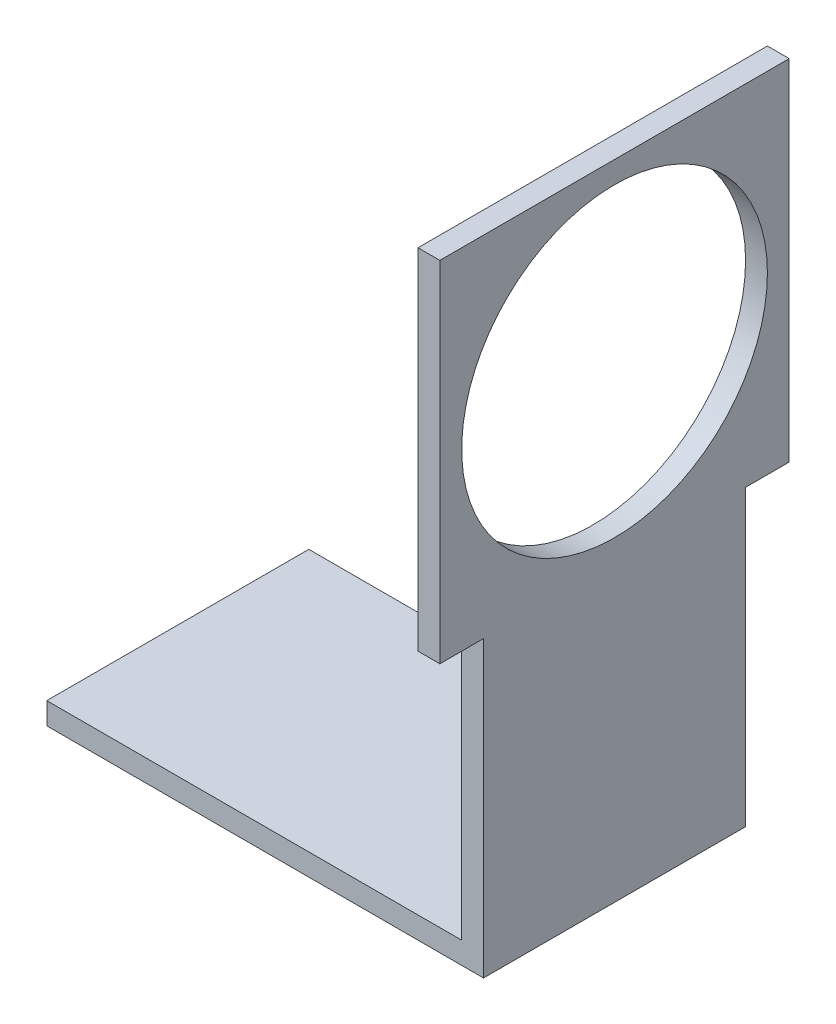
ISO-10303-21;
HEADER;
FILE_DESCRIPTION(('STEP AP214'),'2;1');
FILE_NAME('part.step','',(''),(''),'','','');
FILE_SCHEMA(('AUTOMOTIVE_DESIGN { 1 0 10303 214 1 1 1 1 }'));
ENDSEC;
DATA;
#1=APPLICATION_CONTEXT('core data for automotive mechanical design processes');
#2=APPLICATION_PROTOCOL_DEFINITION('international standard','automotive_design',2000,#1);
#3=PRODUCT_CONTEXT('',#1,'mechanical');
#4=PRODUCT('Part','Part','',(#3));
#5=PRODUCT_RELATED_PRODUCT_CATEGORY('part','',(#4));
#6=PRODUCT_DEFINITION_FORMATION('','',#4);
#7=PRODUCT_DEFINITION_CONTEXT('part definition',#1,'design');
#8=PRODUCT_DEFINITION('design','',#6,#7);
#9=PRODUCT_DEFINITION_SHAPE('','',#8);
#10=(LENGTH_UNIT() NAMED_UNIT(*) SI_UNIT(.MILLI.,.METRE.));
#11=(NAMED_UNIT(*) PLANE_ANGLE_UNIT() SI_UNIT($,.RADIAN.));
#12=(NAMED_UNIT(*) SI_UNIT($,.STERADIAN.) SOLID_ANGLE_UNIT());
#13=UNCERTAINTY_MEASURE_WITH_UNIT(LENGTH_MEASURE(1.E-05),#10,'distance_accuracy_value','');
#14=(GEOMETRIC_REPRESENTATION_CONTEXT(3) GLOBAL_UNCERTAINTY_ASSIGNED_CONTEXT((#13)) GLOBAL_UNIT_ASSIGNED_CONTEXT((#10,
#11,#12)) REPRESENTATION_CONTEXT('',''));
#15=CARTESIAN_POINT('',(0.,0.,0.));
#16=DIRECTION('',(0.,0.,1.));
#17=DIRECTION('',(1.,0.,0.));
#18=AXIS2_PLACEMENT_3D('',#15,#16,#17);
#19=CARTESIAN_POINT('',(-93.0573248407643,5.,-30.7643312101911));
#20=DIRECTION('',(1.,0.,0.));
#21=DIRECTION('',(0.,0.,-1.));
#22=AXIS2_PLACEMENT_3D('',#19,#20,#21);
#23=PLANE('',#22);
#24=DIRECTION('',(0.,0.,1.));
#25=VECTOR('',#24,1.);
#26=CARTESIAN_POINT('',(-93.0573248407643,0.,-30.7643312101911));
#27=LINE('',#26,#25);
#28=CARTESIAN_POINT('',(-93.0573248407643,0.,-30.7643312101911));
#29=VERTEX_POINT('',#28);
#30=CARTESIAN_POINT('',(-93.0573248407643,0.,29.2356687898089));
#31=VERTEX_POINT('',#30);
#32=EDGE_CURVE('E97',#29,#31,#27,.T.);
#33=ORIENTED_EDGE('',*,*,#32,.T.);
#34=DIRECTION('',(0.,-1.,0.));
#35=VECTOR('',#34,1.);
#36=CARTESIAN_POINT('',(-93.0573248407643,5.,29.2356687898089));
#37=LINE('',#36,#35);
#38=CARTESIAN_POINT('',(-93.0573248407643,5.,29.2356687898089));
#39=VERTEX_POINT('',#38);
#40=EDGE_CURVE('E11',#39,#31,#37,.T.);
#41=ORIENTED_EDGE('',*,*,#40,.F.);
#42=DIRECTION('',(0.,0.,1.));
#43=VECTOR('',#42,1.);
#44=CARTESIAN_POINT('',(-93.0573248407643,5.,-30.7643312101911));
#45=LINE('',#44,#43);
#46=CARTESIAN_POINT('',(-93.0573248407643,5.,-30.7643312101911));
#47=VERTEX_POINT('',#46);
#48=EDGE_CURVE('E91',#47,#39,#45,.T.);
#49=ORIENTED_EDGE('',*,*,#48,.F.);
#50=DIRECTION('',(0.,-1.,0.));
#51=VECTOR('',#50,1.);
#52=CARTESIAN_POINT('',(-93.0573248407643,5.,-30.7643312101911));
#53=LINE('',#52,#51);
#54=EDGE_CURVE('E82',#47,#29,#53,.T.);
#55=ORIENTED_EDGE('',*,*,#54,.T.);
#56=EDGE_LOOP('',(#33,#41,#49,#55));
#57=FACE_BOUND('',#56,.T.);
#58=ADVANCED_FACE('F39',(#57),#23,.F.);
#59=CARTESIAN_POINT('',(-93.0573248407643,5.,29.2356687898089));
#60=DIRECTION('',(0.,0.,-1.));
#61=DIRECTION('',(-1.,0.,0.));
#62=AXIS2_PLACEMENT_3D('',#59,#60,#61);
#63=PLANE('',#62);
#64=DIRECTION('',(1.,0.,0.));
#65=VECTOR('',#64,1.);
#66=CARTESIAN_POINT('',(-93.0573248407643,0.,29.2356687898089));
#67=LINE('',#66,#65);
#68=CARTESIAN_POINT('',(6.94267515923568,0.,29.2356687898089));
#69=VERTEX_POINT('',#68);
#70=EDGE_CURVE('E101',#31,#69,#67,.T.);
#71=ORIENTED_EDGE('',*,*,#70,.T.);
#72=DIRECTION('',(0.,-1.,0.));
#73=VECTOR('',#72,1.);
#74=CARTESIAN_POINT('',(6.94267515923568,5.,29.2356687898089));
#75=LINE('',#74,#73);
#76=CARTESIAN_POINT('',(6.94267515923568,67.3,29.2356687898089));
#77=VERTEX_POINT('',#76);
#78=EDGE_CURVE('E47',#77,#69,#75,.T.);
#79=ORIENTED_EDGE('',*,*,#78,.F.);
#80=DIRECTION('',(1.,0.,0.));
#81=VECTOR('',#80,1.);
#82=CARTESIAN_POINT('',(6.94267515923566,67.3,29.2356687898089));
#83=LINE('',#82,#81);
#84=CARTESIAN_POINT('',(1.94267515923567,67.3,29.2356687898089));
#85=VERTEX_POINT('',#84);
#86=EDGE_CURVE('E132',#85,#77,#83,.T.);
#87=ORIENTED_EDGE('',*,*,#86,.F.);
#88=DIRECTION('',(0.,-1.,0.));
#89=VECTOR('',#88,1.);
#90=CARTESIAN_POINT('',(1.94267515923567,67.3,29.2356687898089));
#91=LINE('',#90,#89);
#92=CARTESIAN_POINT('',(1.94267515923567,5.,29.2356687898089));
#93=VERTEX_POINT('',#92);
#94=EDGE_CURVE('E109',#85,#93,#91,.T.);
#95=ORIENTED_EDGE('',*,*,#94,.T.);
#96=DIRECTION('',(1.,0.,0.));
#97=VECTOR('',#96,1.);
#98=CARTESIAN_POINT('',(-93.0573248407643,5.,29.2356687898089));
#99=LINE('',#98,#97);
#100=EDGE_CURVE('E158',#39,#93,#99,.T.);
#101=ORIENTED_EDGE('',*,*,#100,.F.);
#102=ORIENTED_EDGE('',*,*,#40,.T.);
#103=EDGE_LOOP('',(#71,#79,#87,#95,#101,#102));
#104=FACE_BOUND('',#103,.T.);
#105=ADVANCED_FACE('F130',(#104),#63,.F.);
#106=CARTESIAN_POINT('',(6.94267515923566,5.,-30.7643312101911));
#107=DIRECTION('',(-1.,0.,0.));
#108=DIRECTION('',(0.,0.,1.));
#109=AXIS2_PLACEMENT_3D('',#106,#107,#108);
#110=PLANE('',#109);
#111=CARTESIAN_POINT('',(6.94267515923567,107.3,-0.764331210191082));
#112=DIRECTION('',(1.,0.,0.));
#113=DIRECTION('',(0.,0.,-1.));
#114=AXIS2_PLACEMENT_3D('',#111,#112,#113);
#115=CIRCLE('',#114,35.);
#116=CARTESIAN_POINT('',(6.94267515923566,107.3,-35.7643312101911));
#117=VERTEX_POINT('',#116);
#118=EDGE_CURVE('E193',#117,#117,#115,.T.);
#119=ORIENTED_EDGE('',*,*,#118,.F.);
#120=EDGE_LOOP('',(#119));
#121=FACE_BOUND('',#120,.T.);
#122=DIRECTION('',(0.,0.,-1.));
#123=VECTOR('',#122,1.);
#124=CARTESIAN_POINT('',(6.94267515923566,0.,-30.7643312101911));
#125=LINE('',#124,#123);
#126=CARTESIAN_POINT('',(6.94267515923566,0.,-30.7643312101911));
#127=VERTEX_POINT('',#126);
#128=EDGE_CURVE('E92',#69,#127,#125,.T.);
#129=ORIENTED_EDGE('',*,*,#128,.T.);
#130=DIRECTION('',(0.,-1.,0.));
#131=VECTOR('',#130,1.);
#132=CARTESIAN_POINT('',(6.94267515923566,5.,-30.7643312101911));
#133=LINE('',#132,#131);
#134=CARTESIAN_POINT('',(6.94267515923566,67.3,-30.7643312101911));
#135=VERTEX_POINT('',#134);
#136=EDGE_CURVE('E86',#135,#127,#133,.T.);
#137=ORIENTED_EDGE('',*,*,#136,.F.);
#138=DIRECTION('',(0.,0.,-1.));
#139=VECTOR('',#138,1.);
#140=CARTESIAN_POINT('',(6.94267515923568,67.3,29.2356687898089));
#141=LINE('',#140,#139);
#142=CARTESIAN_POINT('',(6.94267515923566,67.3,-40.7643312101911));
#143=VERTEX_POINT('',#142);
#144=EDGE_CURVE('E180',#135,#143,#141,.T.);
#145=ORIENTED_EDGE('',*,*,#144,.T.);
#146=DIRECTION('',(0.,1.,0.));
#147=VECTOR('',#146,1.);
#148=CARTESIAN_POINT('',(6.94267515923566,67.3,-40.7643312101911));
#149=LINE('',#148,#147);
#150=CARTESIAN_POINT('',(6.94267515923566,147.3,-40.7643312101911));
#151=VERTEX_POINT('',#150);
#152=EDGE_CURVE('E191',#143,#151,#149,.T.);
#153=ORIENTED_EDGE('',*,*,#152,.T.);
#154=DIRECTION('',(0.,0.,1.));
#155=VECTOR('',#154,1.);
#156=CARTESIAN_POINT('',(6.94267515923566,147.3,-40.7643312101911));
#157=LINE('',#156,#155);
#158=CARTESIAN_POINT('',(6.94267515923568,147.3,39.2356687898089));
#159=VERTEX_POINT('',#158);
#160=EDGE_CURVE('E201',#151,#159,#157,.T.);
#161=ORIENTED_EDGE('',*,*,#160,.T.);
#162=DIRECTION('',(0.,-1.,0.));
#163=VECTOR('',#162,1.);
#164=CARTESIAN_POINT('',(6.94267515923568,147.3,39.2356687898089));
#165=LINE('',#164,#163);
#166=CARTESIAN_POINT('',(6.94267515923568,67.3,39.2356687898089));
#167=VERTEX_POINT('',#166);
#168=EDGE_CURVE('E205',#159,#167,#165,.T.);
#169=ORIENTED_EDGE('',*,*,#168,.T.);
#170=EDGE_CURVE('E126',#167,#77,#141,.T.);
#171=ORIENTED_EDGE('',*,*,#170,.T.);
#172=ORIENTED_EDGE('',*,*,#78,.T.);
#173=EDGE_LOOP('',(#129,#137,#145,#153,#161,#169,#171,#172));
#174=FACE_BOUND('',#173,.T.);
#175=ADVANCED_FACE('F122',(#121,#174),#110,.F.);
#176=CARTESIAN_POINT('',(-93.0573248407643,5.,-30.7643312101911));
#177=DIRECTION('',(0.,0.,1.));
#178=DIRECTION('',(1.,0.,0.));
#179=AXIS2_PLACEMENT_3D('',#176,#177,#178);
#180=PLANE('',#179);
#181=DIRECTION('',(-1.,0.,0.));
#182=VECTOR('',#181,1.);
#183=CARTESIAN_POINT('',(-93.0573248407643,0.,-30.7643312101911));
#184=LINE('',#183,#182);
#185=EDGE_CURVE('E79',#127,#29,#184,.T.);
#186=ORIENTED_EDGE('',*,*,#185,.T.);
#187=ORIENTED_EDGE('',*,*,#54,.F.);
#188=DIRECTION('',(-1.,0.,0.));
#189=VECTOR('',#188,1.);
#190=CARTESIAN_POINT('',(-93.0573248407643,5.,-30.7643312101911));
#191=LINE('',#190,#189);
#192=CARTESIAN_POINT('',(1.94267515923567,5.,-30.7643312101911));
#193=VERTEX_POINT('',#192);
#194=EDGE_CURVE('E59',#193,#47,#191,.T.);
#195=ORIENTED_EDGE('',*,*,#194,.F.);
#196=DIRECTION('',(0.,-1.,0.));
#197=VECTOR('',#196,1.);
#198=CARTESIAN_POINT('',(1.94267515923566,67.3,-30.7643312101911));
#199=LINE('',#198,#197);
#200=CARTESIAN_POINT('',(1.94267515923566,67.3,-30.7643312101911));
#201=VERTEX_POINT('',#200);
#202=EDGE_CURVE('E103',#201,#193,#199,.T.);
#203=ORIENTED_EDGE('',*,*,#202,.F.);
#204=DIRECTION('',(-1.,0.,0.));
#205=VECTOR('',#204,1.);
#206=CARTESIAN_POINT('',(6.94267515923566,67.3,-30.7643312101911));
#207=LINE('',#206,#205);
#208=EDGE_CURVE('E145',#135,#201,#207,.T.);
#209=ORIENTED_EDGE('',*,*,#208,.F.);
#210=ORIENTED_EDGE('',*,*,#136,.T.);
#211=EDGE_LOOP('',(#186,#187,#195,#203,#209,#210));
#212=FACE_BOUND('',#211,.T.);
#213=ADVANCED_FACE('F81',(#212),#180,.F.);
#214=CARTESIAN_POINT('',(0.,5.,0.));
#215=DIRECTION('',(0.,1.,0.));
#216=DIRECTION('',(0.,0.,1.));
#217=AXIS2_PLACEMENT_3D('',#214,#215,#216);
#218=PLANE('',#217);
#219=DIRECTION('',(0.,0.,1.));
#220=VECTOR('',#219,1.);
#221=CARTESIAN_POINT('',(1.94267515923566,5.,-30.7643312101911));
#222=LINE('',#221,#220);
#223=EDGE_CURVE('E54',#193,#93,#222,.T.);
#224=ORIENTED_EDGE('',*,*,#223,.F.);
#225=ORIENTED_EDGE('',*,*,#194,.T.);
#226=ORIENTED_EDGE('',*,*,#48,.T.);
#227=ORIENTED_EDGE('',*,*,#100,.T.);
#228=EDGE_LOOP('',(#224,#225,#226,#227));
#229=FACE_BOUND('',#228,.T.);
#230=ADVANCED_FACE('F161',(#229),#218,.T.);
#231=CARTESIAN_POINT('',(0.,0.,0.));
#232=DIRECTION('',(0.,1.,0.));
#233=DIRECTION('',(0.,0.,1.));
#234=AXIS2_PLACEMENT_3D('',#231,#232,#233);
#235=PLANE('',#234);
#236=ORIENTED_EDGE('',*,*,#32,.F.);
#237=ORIENTED_EDGE('',*,*,#185,.F.);
#238=ORIENTED_EDGE('',*,*,#128,.F.);
#239=ORIENTED_EDGE('',*,*,#70,.F.);
#240=EDGE_LOOP('',(#236,#237,#238,#239));
#241=FACE_BOUND('',#240,.T.);
#242=ADVANCED_FACE('F100',(#241),#235,.F.);
#243=CARTESIAN_POINT('',(1.94267515923566,67.3,-30.7643312101911));
#244=DIRECTION('',(1.,0.,0.));
#245=DIRECTION('',(0.,0.,-1.));
#246=AXIS2_PLACEMENT_3D('',#243,#244,#245);
#247=PLANE('',#246);
#248=CARTESIAN_POINT('',(1.94267515923567,107.3,-0.76433121019108));
#249=DIRECTION('',(1.,0.,0.));
#250=DIRECTION('',(0.,0.,-1.));
#251=AXIS2_PLACEMENT_3D('',#248,#249,#250);
#252=CIRCLE('',#251,35.);
#253=CARTESIAN_POINT('',(1.94267515923566,107.3,-35.7643312101911));
#254=VERTEX_POINT('',#253);
#255=EDGE_CURVE('E187',#254,#254,#252,.T.);
#256=ORIENTED_EDGE('',*,*,#255,.T.);
#257=EDGE_LOOP('',(#256));
#258=FACE_BOUND('',#257,.T.);
#259=ORIENTED_EDGE('',*,*,#223,.T.);
#260=ORIENTED_EDGE('',*,*,#94,.F.);
#261=DIRECTION('',(0.,0.,-1.));
#262=VECTOR('',#261,1.);
#263=CARTESIAN_POINT('',(1.94267515923568,67.3,39.2356687898089));
#264=LINE('',#263,#262);
#265=CARTESIAN_POINT('',(1.94267515923568,67.3,39.2356687898089));
#266=VERTEX_POINT('',#265);
#267=EDGE_CURVE('E143',#266,#85,#264,.T.);
#268=ORIENTED_EDGE('',*,*,#267,.F.);
#269=DIRECTION('',(0.,-1.,0.));
#270=VECTOR('',#269,1.);
#271=CARTESIAN_POINT('',(1.94267515923568,147.3,39.2356687898089));
#272=LINE('',#271,#270);
#273=CARTESIAN_POINT('',(1.94267515923568,147.3,39.2356687898089));
#274=VERTEX_POINT('',#273);
#275=EDGE_CURVE('E197',#274,#266,#272,.T.);
#276=ORIENTED_EDGE('',*,*,#275,.F.);
#277=DIRECTION('',(0.,0.,1.));
#278=VECTOR('',#277,1.);
#279=CARTESIAN_POINT('',(1.94267515923566,147.3,-40.7643312101911));
#280=LINE('',#279,#278);
#281=CARTESIAN_POINT('',(1.94267515923566,147.3,-40.7643312101911));
#282=VERTEX_POINT('',#281);
#283=EDGE_CURVE('E220',#282,#274,#280,.T.);
#284=ORIENTED_EDGE('',*,*,#283,.F.);
#285=DIRECTION('',(0.,1.,0.));
#286=VECTOR('',#285,1.);
#287=CARTESIAN_POINT('',(1.94267515923566,67.3,-40.7643312101911));
#288=LINE('',#287,#286);
#289=CARTESIAN_POINT('',(1.94267515923566,67.3,-40.7643312101911));
#290=VERTEX_POINT('',#289);
#291=EDGE_CURVE('E226',#290,#282,#288,.T.);
#292=ORIENTED_EDGE('',*,*,#291,.F.);
#293=EDGE_CURVE('E171',#201,#290,#264,.T.);
#294=ORIENTED_EDGE('',*,*,#293,.F.);
#295=ORIENTED_EDGE('',*,*,#202,.T.);
#296=EDGE_LOOP('',(#259,#260,#268,#276,#284,#292,#294,#295));
#297=FACE_BOUND('',#296,.T.);
#298=ADVANCED_FACE('F165',(#258,#297),#247,.F.);
#299=CARTESIAN_POINT('',(1.94267515923568,67.3,29.2356687898089));
#300=DIRECTION('',(0.,-1.,0.));
#301=DIRECTION('',(0.,0.,-1.));
#302=AXIS2_PLACEMENT_3D('',#299,#300,#301);
#303=PLANE('',#302);
#304=ORIENTED_EDGE('',*,*,#144,.F.);
#305=ORIENTED_EDGE('',*,*,#208,.T.);
#306=ORIENTED_EDGE('',*,*,#293,.T.);
#307=DIRECTION('',(1.,0.,0.));
#308=VECTOR('',#307,1.);
#309=CARTESIAN_POINT('',(1.94267515923566,67.3,-40.7643312101911));
#310=LINE('',#309,#308);
#311=EDGE_CURVE('E182',#290,#143,#310,.T.);
#312=ORIENTED_EDGE('',*,*,#311,.T.);
#313=EDGE_LOOP('',(#304,#305,#306,#312));
#314=FACE_BOUND('',#313,.T.);
#315=ADVANCED_FACE('F175',(#314),#303,.T.);
#316=CARTESIAN_POINT('',(1.94267515923568,147.3,39.2356687898089));
#317=DIRECTION('',(0.,0.,1.));
#318=DIRECTION('',(1.,0.,0.));
#319=AXIS2_PLACEMENT_3D('',#316,#317,#318);
#320=PLANE('',#319);
#321=ORIENTED_EDGE('',*,*,#168,.F.);
#322=DIRECTION('',(1.,0.,0.));
#323=VECTOR('',#322,1.);
#324=CARTESIAN_POINT('',(1.94267515923568,147.3,39.2356687898089));
#325=LINE('',#324,#323);
#326=EDGE_CURVE('E210',#274,#159,#325,.T.);
#327=ORIENTED_EDGE('',*,*,#326,.F.);
#328=ORIENTED_EDGE('',*,*,#275,.T.);
#329=DIRECTION('',(1.,0.,0.));
#330=VECTOR('',#329,1.);
#331=CARTESIAN_POINT('',(1.94267515923568,67.3,39.2356687898089));
#332=LINE('',#331,#330);
#333=EDGE_CURVE('E155',#266,#167,#332,.T.);
#334=ORIENTED_EDGE('',*,*,#333,.T.);
#335=EDGE_LOOP('',(#321,#327,#328,#334));
#336=FACE_BOUND('',#335,.T.);
#337=ADVANCED_FACE('F282',(#336),#320,.T.);
#338=CARTESIAN_POINT('',(1.94267515923566,147.3,-40.7643312101911));
#339=DIRECTION('',(0.,1.,0.));
#340=DIRECTION('',(0.,0.,1.));
#341=AXIS2_PLACEMENT_3D('',#338,#339,#340);
#342=PLANE('',#341);
#343=ORIENTED_EDGE('',*,*,#160,.F.);
#344=DIRECTION('',(1.,0.,0.));
#345=VECTOR('',#344,1.);
#346=CARTESIAN_POINT('',(1.94267515923566,147.3,-40.7643312101911));
#347=LINE('',#346,#345);
#348=EDGE_CURVE('E214',#282,#151,#347,.T.);
#349=ORIENTED_EDGE('',*,*,#348,.F.);
#350=ORIENTED_EDGE('',*,*,#283,.T.);
#351=ORIENTED_EDGE('',*,*,#326,.T.);
#352=EDGE_LOOP('',(#343,#349,#350,#351));
#353=FACE_BOUND('',#352,.T.);
#354=ADVANCED_FACE('F293',(#353),#342,.T.);
#355=CARTESIAN_POINT('',(1.94267515923566,67.3,-40.7643312101911));
#356=DIRECTION('',(0.,0.,-1.));
#357=DIRECTION('',(-1.,0.,0.));
#358=AXIS2_PLACEMENT_3D('',#355,#356,#357);
#359=PLANE('',#358);
#360=ORIENTED_EDGE('',*,*,#152,.F.);
#361=ORIENTED_EDGE('',*,*,#311,.F.);
#362=ORIENTED_EDGE('',*,*,#291,.T.);
#363=ORIENTED_EDGE('',*,*,#348,.T.);
#364=EDGE_LOOP('',(#360,#361,#362,#363));
#365=FACE_BOUND('',#364,.T.);
#366=ADVANCED_FACE('F302',(#365),#359,.T.);
#367=ORIENTED_EDGE('',*,*,#267,.T.);
#368=ORIENTED_EDGE('',*,*,#86,.T.);
#369=ORIENTED_EDGE('',*,*,#170,.F.);
#370=ORIENTED_EDGE('',*,*,#333,.F.);
#371=EDGE_LOOP('',(#367,#368,#369,#370));
#372=FACE_BOUND('',#371,.T.);
#373=ADVANCED_FACE('F138',(#372),#303,.T.);
#374=CARTESIAN_POINT('',(1.94267515923567,107.3,-0.76433121019108));
#375=DIRECTION('',(1.,0.,0.));
#376=DIRECTION('',(0.,0.,-1.));
#377=AXIS2_PLACEMENT_3D('',#374,#375,#376);
#378=CYLINDRICAL_SURFACE('',#377,35.);
#379=ORIENTED_EDGE('',*,*,#255,.F.);
#380=EDGE_LOOP('',(#379));
#381=FACE_BOUND('',#380,.T.);
#382=ORIENTED_EDGE('',*,*,#118,.T.);
#383=EDGE_LOOP('',(#382));
#384=FACE_BOUND('',#383,.T.);
#385=ADVANCED_FACE('F241',(#381,#384),#378,.F.);
#386=CLOSED_SHELL('',(#58,#105,#175,#213,#230,#242,#298,#315,#337,#354,#366,#373,#385));
#387=MANIFOLD_SOLID_BREP('B2',#386);
#388=ADVANCED_BREP_SHAPE_REPRESENTATION('',(#18,#387),#14);
#389=SHAPE_DEFINITION_REPRESENTATION(#9,#388);
ENDSEC;
END-ISO-10303-21;
